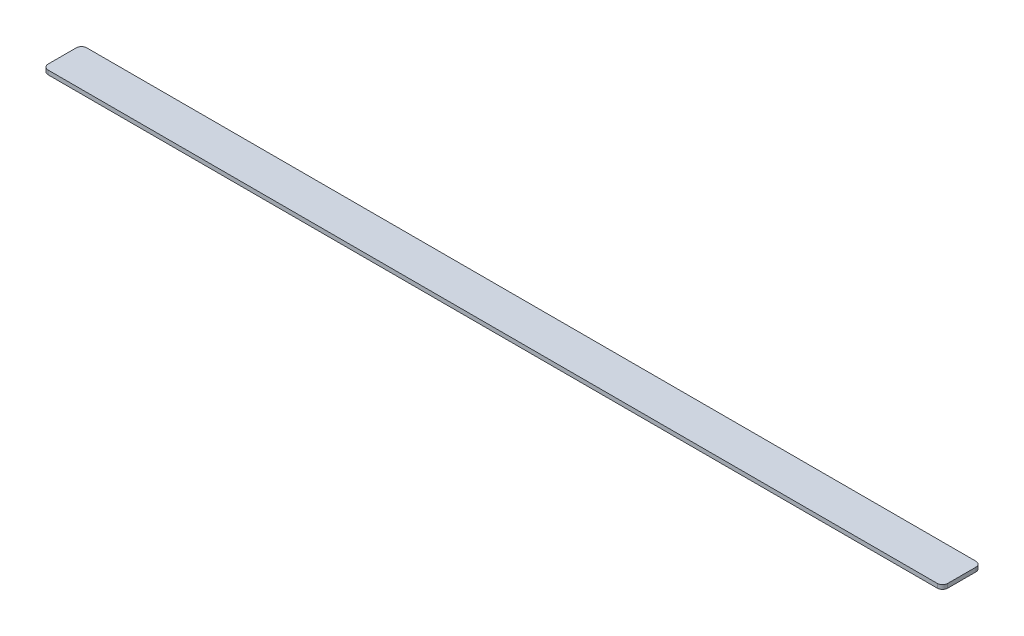
ISO-10303-21;
HEADER;
FILE_DESCRIPTION(('STEP AP214'),'2;1');
FILE_NAME('part.step','',(''),(''),'','','');
FILE_SCHEMA(('AUTOMOTIVE_DESIGN { 1 0 10303 214 1 1 1 1 }'));
ENDSEC;
DATA;
#1=APPLICATION_CONTEXT('core data for automotive mechanical design processes');
#2=APPLICATION_PROTOCOL_DEFINITION('international standard','automotive_design',2000,#1);
#3=PRODUCT_CONTEXT('',#1,'mechanical');
#4=PRODUCT('Part','Part','',(#3));
#5=PRODUCT_RELATED_PRODUCT_CATEGORY('part','',(#4));
#6=PRODUCT_DEFINITION_FORMATION('','',#4);
#7=PRODUCT_DEFINITION_CONTEXT('part definition',#1,'design');
#8=PRODUCT_DEFINITION('design','',#6,#7);
#9=PRODUCT_DEFINITION_SHAPE('','',#8);
#10=(LENGTH_UNIT() NAMED_UNIT(*) SI_UNIT(.MILLI.,.METRE.));
#11=(NAMED_UNIT(*) PLANE_ANGLE_UNIT() SI_UNIT($,.RADIAN.));
#12=(NAMED_UNIT(*) SI_UNIT($,.STERADIAN.) SOLID_ANGLE_UNIT());
#13=UNCERTAINTY_MEASURE_WITH_UNIT(LENGTH_MEASURE(1.E-05),#10,'distance_accuracy_value','');
#14=(GEOMETRIC_REPRESENTATION_CONTEXT(3) GLOBAL_UNCERTAINTY_ASSIGNED_CONTEXT((#13)) GLOBAL_UNIT_ASSIGNED_CONTEXT((#10,
#11,#12)) REPRESENTATION_CONTEXT('',''));
#15=CARTESIAN_POINT('',(0.,0.,0.));
#16=DIRECTION('',(0.,0.,1.));
#17=DIRECTION('',(1.,0.,0.));
#18=AXIS2_PLACEMENT_3D('',#15,#16,#17);
#19=CARTESIAN_POINT('',(6.,4.76,-38.3));
#20=DIRECTION('',(0.,-1.,0.));
#21=DIRECTION('',(0.,0.,-1.));
#22=AXIS2_PLACEMENT_3D('',#19,#20,#21);
#23=CYLINDRICAL_SURFACE('',#22,6.);
#24=CARTESIAN_POINT('',(6.,0.,-38.3));
#25=DIRECTION('',(0.,1.,0.));
#26=DIRECTION('',(0.,0.,1.));
#27=AXIS2_PLACEMENT_3D('',#24,#25,#26);
#28=CIRCLE('',#27,6.);
#29=CARTESIAN_POINT('',(6.00000000000004,0.,-44.3));
#30=VERTEX_POINT('',#29);
#31=CARTESIAN_POINT('',(0.,0.,-38.3));
#32=VERTEX_POINT('',#31);
#33=EDGE_CURVE('E128',#30,#32,#28,.T.);
#34=ORIENTED_EDGE('',*,*,#33,.T.);
#35=DIRECTION('',(0.,-1.,0.));
#36=VECTOR('',#35,1.);
#37=CARTESIAN_POINT('',(0.,4.76,-38.3));
#38=LINE('',#37,#36);
#39=CARTESIAN_POINT('',(0.,4.76,-38.3));
#40=VERTEX_POINT('',#39);
#41=EDGE_CURVE('E11',#40,#32,#38,.T.);
#42=ORIENTED_EDGE('',*,*,#41,.F.);
#43=CARTESIAN_POINT('',(6.,4.76,-38.3));
#44=DIRECTION('',(0.,1.,0.));
#45=DIRECTION('',(0.,0.,1.));
#46=AXIS2_PLACEMENT_3D('',#43,#44,#45);
#47=CIRCLE('',#46,6.);
#48=CARTESIAN_POINT('',(6.00000000000004,4.76,-44.3));
#49=VERTEX_POINT('',#48);
#50=EDGE_CURVE('E142',#49,#40,#47,.T.);
#51=ORIENTED_EDGE('',*,*,#50,.F.);
#52=DIRECTION('',(0.,-1.,0.));
#53=VECTOR('',#52,1.);
#54=CARTESIAN_POINT('',(6.00000000000004,4.76,-44.3));
#55=LINE('',#54,#53);
#56=EDGE_CURVE('E124',#49,#30,#55,.T.);
#57=ORIENTED_EDGE('',*,*,#56,.T.);
#58=EDGE_LOOP('',(#34,#42,#51,#57));
#59=FACE_BOUND('',#58,.T.);
#60=ADVANCED_FACE('F32',(#59),#23,.T.);
#61=CARTESIAN_POINT('',(0.,4.76,-6.00000000000004));
#62=DIRECTION('',(1.,0.,0.));
#63=DIRECTION('',(0.,0.,-1.));
#64=AXIS2_PLACEMENT_3D('',#61,#62,#63);
#65=PLANE('',#64);
#66=DIRECTION('',(0.,0.,1.));
#67=VECTOR('',#66,1.);
#68=CARTESIAN_POINT('',(0.,0.,-6.00000000000004));
#69=LINE('',#68,#67);
#70=CARTESIAN_POINT('',(0.,0.,-6.00000000000004));
#71=VERTEX_POINT('',#70);
#72=EDGE_CURVE('E131',#32,#71,#69,.T.);
#73=ORIENTED_EDGE('',*,*,#72,.T.);
#74=DIRECTION('',(0.,-1.,0.));
#75=VECTOR('',#74,1.);
#76=CARTESIAN_POINT('',(0.,4.76,-6.00000000000004));
#77=LINE('',#76,#75);
#78=CARTESIAN_POINT('',(0.,4.76,-6.00000000000004));
#79=VERTEX_POINT('',#78);
#80=EDGE_CURVE('E40',#79,#71,#77,.T.);
#81=ORIENTED_EDGE('',*,*,#80,.F.);
#82=DIRECTION('',(0.,0.,1.));
#83=VECTOR('',#82,1.);
#84=CARTESIAN_POINT('',(0.,4.76,-6.00000000000004));
#85=LINE('',#84,#83);
#86=EDGE_CURVE('E91',#40,#79,#85,.T.);
#87=ORIENTED_EDGE('',*,*,#86,.F.);
#88=ORIENTED_EDGE('',*,*,#41,.T.);
#89=EDGE_LOOP('',(#73,#81,#87,#88));
#90=FACE_BOUND('',#89,.T.);
#91=ADVANCED_FACE('F177',(#90),#65,.F.);
#92=CARTESIAN_POINT('',(6.,4.76,-6.));
#93=DIRECTION('',(0.,-1.,0.));
#94=DIRECTION('',(0.,0.,-1.));
#95=AXIS2_PLACEMENT_3D('',#92,#93,#94);
#96=CYLINDRICAL_SURFACE('',#95,6.);
#97=CARTESIAN_POINT('',(6.,0.,-6.));
#98=DIRECTION('',(0.,1.,0.));
#99=DIRECTION('',(0.,0.,1.));
#100=AXIS2_PLACEMENT_3D('',#97,#98,#99);
#101=CIRCLE('',#100,6.);
#102=CARTESIAN_POINT('',(6.00000000000004,0.,0.));
#103=VERTEX_POINT('',#102);
#104=EDGE_CURVE('E133',#71,#103,#101,.T.);
#105=ORIENTED_EDGE('',*,*,#104,.T.);
#106=DIRECTION('',(0.,-1.,0.));
#107=VECTOR('',#106,1.);
#108=CARTESIAN_POINT('',(6.00000000000004,4.76,0.));
#109=LINE('',#108,#107);
#110=CARTESIAN_POINT('',(6.00000000000004,4.76,0.));
#111=VERTEX_POINT('',#110);
#112=EDGE_CURVE('E149',#111,#103,#109,.T.);
#113=ORIENTED_EDGE('',*,*,#112,.F.);
#114=CARTESIAN_POINT('',(6.,4.76,-6.));
#115=DIRECTION('',(0.,1.,0.));
#116=DIRECTION('',(0.,0.,1.));
#117=AXIS2_PLACEMENT_3D('',#114,#115,#116);
#118=CIRCLE('',#117,6.);
#119=EDGE_CURVE('E157',#79,#111,#118,.T.);
#120=ORIENTED_EDGE('',*,*,#119,.F.);
#121=ORIENTED_EDGE('',*,*,#80,.T.);
#122=EDGE_LOOP('',(#105,#113,#120,#121));
#123=FACE_BOUND('',#122,.T.);
#124=ADVANCED_FACE('F155',(#123),#96,.T.);
#125=CARTESIAN_POINT('',(6.00000000000004,4.76,0.));
#126=DIRECTION('',(0.,0.,-1.));
#127=DIRECTION('',(-1.,0.,0.));
#128=AXIS2_PLACEMENT_3D('',#125,#126,#127);
#129=PLANE('',#128);
#130=DIRECTION('',(1.,0.,0.));
#131=VECTOR('',#130,1.);
#132=CARTESIAN_POINT('',(6.00000000000004,0.,0.));
#133=LINE('',#132,#131);
#134=CARTESIAN_POINT('',(1027.5,0.,0.));
#135=VERTEX_POINT('',#134);
#136=EDGE_CURVE('E135',#103,#135,#133,.T.);
#137=ORIENTED_EDGE('',*,*,#136,.T.);
#138=DIRECTION('',(0.,-1.,0.));
#139=VECTOR('',#138,1.);
#140=CARTESIAN_POINT('',(1027.5,4.76,0.));
#141=LINE('',#140,#139);
#142=CARTESIAN_POINT('',(1027.5,4.76,0.));
#143=VERTEX_POINT('',#142);
#144=EDGE_CURVE('E146',#143,#135,#141,.T.);
#145=ORIENTED_EDGE('',*,*,#144,.F.);
#146=DIRECTION('',(1.,0.,0.));
#147=VECTOR('',#146,1.);
#148=CARTESIAN_POINT('',(6.00000000000004,4.76,0.));
#149=LINE('',#148,#147);
#150=EDGE_CURVE('E169',#111,#143,#149,.T.);
#151=ORIENTED_EDGE('',*,*,#150,.F.);
#152=ORIENTED_EDGE('',*,*,#112,.T.);
#153=EDGE_LOOP('',(#137,#145,#151,#152));
#154=FACE_BOUND('',#153,.T.);
#155=ADVANCED_FACE('F165',(#154),#129,.F.);
#156=CARTESIAN_POINT('',(1027.5,4.76,-6.));
#157=DIRECTION('',(0.,-1.,0.));
#158=DIRECTION('',(0.,0.,-1.));
#159=AXIS2_PLACEMENT_3D('',#156,#157,#158);
#160=CYLINDRICAL_SURFACE('',#159,6.);
#161=CARTESIAN_POINT('',(1027.5,0.,-6.));
#162=DIRECTION('',(0.,1.,0.));
#163=DIRECTION('',(0.,0.,-1.));
#164=AXIS2_PLACEMENT_3D('',#161,#162,#163);
#165=CIRCLE('',#164,6.);
#166=CARTESIAN_POINT('',(1033.5,0.,-6.00000000000004));
#167=VERTEX_POINT('',#166);
#168=EDGE_CURVE('E137',#135,#167,#165,.T.);
#169=ORIENTED_EDGE('',*,*,#168,.T.);
#170=DIRECTION('',(0.,-1.,0.));
#171=VECTOR('',#170,1.);
#172=CARTESIAN_POINT('',(1033.5,4.76,-6.00000000000004));
#173=LINE('',#172,#171);
#174=CARTESIAN_POINT('',(1033.5,4.76,-6.00000000000004));
#175=VERTEX_POINT('',#174);
#176=EDGE_CURVE('E119',#175,#167,#173,.T.);
#177=ORIENTED_EDGE('',*,*,#176,.F.);
#178=CARTESIAN_POINT('',(1027.5,4.76,-6.));
#179=DIRECTION('',(0.,1.,0.));
#180=DIRECTION('',(0.,0.,-1.));
#181=AXIS2_PLACEMENT_3D('',#178,#179,#180);
#182=CIRCLE('',#181,6.);
#183=EDGE_CURVE('E110',#143,#175,#182,.T.);
#184=ORIENTED_EDGE('',*,*,#183,.F.);
#185=ORIENTED_EDGE('',*,*,#144,.T.);
#186=EDGE_LOOP('',(#169,#177,#184,#185));
#187=FACE_BOUND('',#186,.T.);
#188=ADVANCED_FACE('F168',(#187),#160,.T.);
#189=CARTESIAN_POINT('',(1033.5,4.76,-6.00000000000004));
#190=DIRECTION('',(-1.,0.,0.));
#191=DIRECTION('',(0.,0.,1.));
#192=AXIS2_PLACEMENT_3D('',#189,#190,#191);
#193=PLANE('',#192);
#194=DIRECTION('',(0.,0.,-1.));
#195=VECTOR('',#194,1.);
#196=CARTESIAN_POINT('',(1033.5,0.,-6.00000000000004));
#197=LINE('',#196,#195);
#198=CARTESIAN_POINT('',(1033.5,0.,-38.3));
#199=VERTEX_POINT('',#198);
#200=EDGE_CURVE('E118',#167,#199,#197,.T.);
#201=ORIENTED_EDGE('',*,*,#200,.T.);
#202=DIRECTION('',(0.,-1.,0.));
#203=VECTOR('',#202,1.);
#204=CARTESIAN_POINT('',(1033.5,4.76,-38.3));
#205=LINE('',#204,#203);
#206=CARTESIAN_POINT('',(1033.5,4.76,-38.3));
#207=VERTEX_POINT('',#206);
#208=EDGE_CURVE('E115',#207,#199,#205,.T.);
#209=ORIENTED_EDGE('',*,*,#208,.F.);
#210=DIRECTION('',(0.,0.,-1.));
#211=VECTOR('',#210,1.);
#212=CARTESIAN_POINT('',(1033.5,4.76,-6.00000000000004));
#213=LINE('',#212,#211);
#214=EDGE_CURVE('E104',#175,#207,#213,.T.);
#215=ORIENTED_EDGE('',*,*,#214,.F.);
#216=ORIENTED_EDGE('',*,*,#176,.T.);
#217=EDGE_LOOP('',(#201,#209,#215,#216));
#218=FACE_BOUND('',#217,.T.);
#219=ADVANCED_FACE('F116',(#218),#193,.F.);
#220=CARTESIAN_POINT('',(1027.5,4.76,-38.3));
#221=DIRECTION('',(0.,-1.,0.));
#222=DIRECTION('',(0.,0.,-1.));
#223=AXIS2_PLACEMENT_3D('',#220,#221,#222);
#224=CYLINDRICAL_SURFACE('',#223,6.);
#225=CARTESIAN_POINT('',(1027.5,0.,-38.3));
#226=DIRECTION('',(0.,1.,0.));
#227=DIRECTION('',(0.,0.,-1.));
#228=AXIS2_PLACEMENT_3D('',#225,#226,#227);
#229=CIRCLE('',#228,6.);
#230=CARTESIAN_POINT('',(1027.5,0.,-44.3));
#231=VERTEX_POINT('',#230);
#232=EDGE_CURVE('E77',#199,#231,#229,.T.);
#233=ORIENTED_EDGE('',*,*,#232,.T.);
#234=DIRECTION('',(0.,-1.,0.));
#235=VECTOR('',#234,1.);
#236=CARTESIAN_POINT('',(1027.5,4.76,-44.3));
#237=LINE('',#236,#235);
#238=CARTESIAN_POINT('',(1027.5,4.76,-44.3));
#239=VERTEX_POINT('',#238);
#240=EDGE_CURVE('E120',#239,#231,#237,.T.);
#241=ORIENTED_EDGE('',*,*,#240,.F.);
#242=CARTESIAN_POINT('',(1027.5,4.76,-38.3));
#243=DIRECTION('',(0.,1.,0.));
#244=DIRECTION('',(0.,0.,-1.));
#245=AXIS2_PLACEMENT_3D('',#242,#243,#244);
#246=CIRCLE('',#245,6.);
#247=EDGE_CURVE('E108',#207,#239,#246,.T.);
#248=ORIENTED_EDGE('',*,*,#247,.F.);
#249=ORIENTED_EDGE('',*,*,#208,.T.);
#250=EDGE_LOOP('',(#233,#241,#248,#249));
#251=FACE_BOUND('',#250,.T.);
#252=ADVANCED_FACE('F122',(#251),#224,.T.);
#253=CARTESIAN_POINT('',(6.00000000000004,4.76,-44.3));
#254=DIRECTION('',(0.,0.,1.));
#255=DIRECTION('',(1.,0.,0.));
#256=AXIS2_PLACEMENT_3D('',#253,#254,#255);
#257=PLANE('',#256);
#258=DIRECTION('',(-1.,0.,0.));
#259=VECTOR('',#258,1.);
#260=CARTESIAN_POINT('',(6.00000000000004,0.,-44.3));
#261=LINE('',#260,#259);
#262=EDGE_CURVE('E83',#231,#30,#261,.T.);
#263=ORIENTED_EDGE('',*,*,#262,.T.);
#264=ORIENTED_EDGE('',*,*,#56,.F.);
#265=DIRECTION('',(-1.,0.,0.));
#266=VECTOR('',#265,1.);
#267=CARTESIAN_POINT('',(6.00000000000004,4.76,-44.3));
#268=LINE('',#267,#266);
#269=EDGE_CURVE('E48',#239,#49,#268,.T.);
#270=ORIENTED_EDGE('',*,*,#269,.F.);
#271=ORIENTED_EDGE('',*,*,#240,.T.);
#272=EDGE_LOOP('',(#263,#264,#270,#271));
#273=FACE_BOUND('',#272,.T.);
#274=ADVANCED_FACE('F193',(#273),#257,.F.);
#275=CARTESIAN_POINT('',(6.,4.76,-38.3));
#276=DIRECTION('',(0.,1.,0.));
#277=DIRECTION('',(0.,0.,1.));
#278=AXIS2_PLACEMENT_3D('',#275,#276,#277);
#279=PLANE('',#278);
#280=ORIENTED_EDGE('',*,*,#50,.T.);
#281=ORIENTED_EDGE('',*,*,#86,.T.);
#282=ORIENTED_EDGE('',*,*,#119,.T.);
#283=ORIENTED_EDGE('',*,*,#150,.T.);
#284=ORIENTED_EDGE('',*,*,#183,.T.);
#285=ORIENTED_EDGE('',*,*,#214,.T.);
#286=ORIENTED_EDGE('',*,*,#247,.T.);
#287=ORIENTED_EDGE('',*,*,#269,.T.);
#288=EDGE_LOOP('',(#280,#281,#282,#283,#284,#285,#286,#287));
#289=FACE_BOUND('',#288,.T.);
#290=ADVANCED_FACE('F106',(#289),#279,.T.);
#291=CARTESIAN_POINT('',(6.,0.,-38.3));
#292=DIRECTION('',(0.,1.,0.));
#293=DIRECTION('',(0.,0.,1.));
#294=AXIS2_PLACEMENT_3D('',#291,#292,#293);
#295=PLANE('',#294);
#296=ORIENTED_EDGE('',*,*,#33,.F.);
#297=ORIENTED_EDGE('',*,*,#262,.F.);
#298=ORIENTED_EDGE('',*,*,#232,.F.);
#299=ORIENTED_EDGE('',*,*,#200,.F.);
#300=ORIENTED_EDGE('',*,*,#168,.F.);
#301=ORIENTED_EDGE('',*,*,#136,.F.);
#302=ORIENTED_EDGE('',*,*,#104,.F.);
#303=ORIENTED_EDGE('',*,*,#72,.F.);
#304=EDGE_LOOP('',(#296,#297,#298,#299,#300,#301,#302,#303));
#305=FACE_BOUND('',#304,.T.);
#306=ADVANCED_FACE('F161',(#305),#295,.F.);
#307=CLOSED_SHELL('',(#60,#91,#124,#155,#188,#219,#252,#274,#290,#306));
#308=MANIFOLD_SOLID_BREP('B2',#307);
#309=ADVANCED_BREP_SHAPE_REPRESENTATION('',(#18,#308),#14);
#310=SHAPE_DEFINITION_REPRESENTATION(#9,#309);
ENDSEC;
END-ISO-10303-21;
